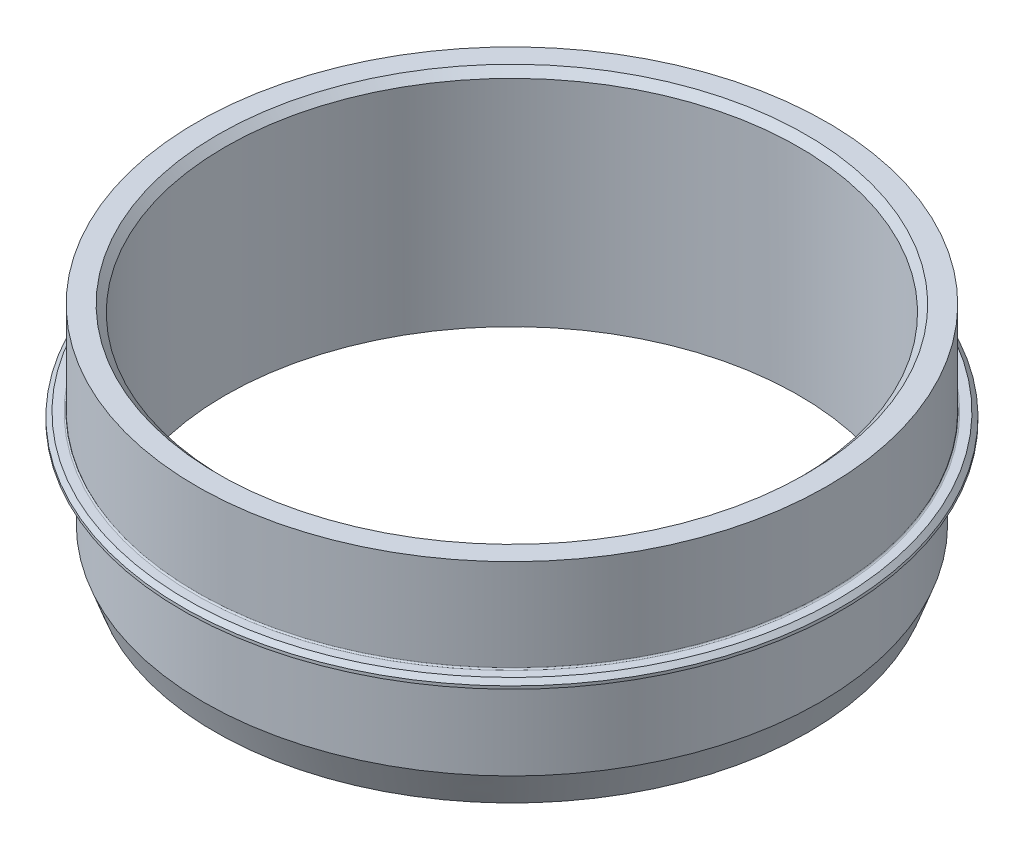
ISO-10303-21;
HEADER;
FILE_DESCRIPTION(('STEP AP214'),'2;1');
FILE_NAME('part.step','',(''),(''),'','','');
FILE_SCHEMA(('AUTOMOTIVE_DESIGN { 1 0 10303 214 1 1 1 1 }'));
ENDSEC;
DATA;
#1=APPLICATION_CONTEXT('core data for automotive mechanical design processes');
#2=APPLICATION_PROTOCOL_DEFINITION('international standard','automotive_design',2000,#1);
#3=PRODUCT_CONTEXT('',#1,'mechanical');
#4=PRODUCT('Part','Part','',(#3));
#5=PRODUCT_RELATED_PRODUCT_CATEGORY('part','',(#4));
#6=PRODUCT_DEFINITION_FORMATION('','',#4);
#7=PRODUCT_DEFINITION_CONTEXT('part definition',#1,'design');
#8=PRODUCT_DEFINITION('design','',#6,#7);
#9=PRODUCT_DEFINITION_SHAPE('','',#8);
#10=(LENGTH_UNIT() NAMED_UNIT(*) SI_UNIT(.MILLI.,.METRE.));
#11=(NAMED_UNIT(*) PLANE_ANGLE_UNIT() SI_UNIT($,.RADIAN.));
#12=(NAMED_UNIT(*) SI_UNIT($,.STERADIAN.) SOLID_ANGLE_UNIT());
#13=UNCERTAINTY_MEASURE_WITH_UNIT(LENGTH_MEASURE(1.E-05),#10,'distance_accuracy_value','');
#14=(GEOMETRIC_REPRESENTATION_CONTEXT(3) GLOBAL_UNCERTAINTY_ASSIGNED_CONTEXT((#13)) GLOBAL_UNIT_ASSIGNED_CONTEXT((#10,
#11,#12)) REPRESENTATION_CONTEXT('',''));
#15=CARTESIAN_POINT('',(0.,0.,0.));
#16=DIRECTION('',(0.,0.,1.));
#17=DIRECTION('',(1.,0.,0.));
#18=AXIS2_PLACEMENT_3D('',#15,#16,#17);
#19=CARTESIAN_POINT('',(0.,-33.5,659.57));
#20=DIRECTION('',(0.,1.,0.));
#21=DIRECTION('',(-1.,0.,0.));
#22=AXIS2_PLACEMENT_3D('',#19,#20,#21);
#23=PLANE('',#22);
#24=CARTESIAN_POINT('',(0.,-33.5,705.55));
#25=DIRECTION('',(0.,-1.,0.));
#26=DIRECTION('',(1.,0.,0.));
#27=AXIS2_PLACEMENT_3D('',#24,#25,#26);
#28=CIRCLE('',#27,44.18);
#29=CARTESIAN_POINT('',(44.18,-33.5,705.55));
#30=VERTEX_POINT('',#29);
#31=EDGE_CURVE('E105',#30,#30,#28,.T.);
#32=ORIENTED_EDGE('',*,*,#31,.T.);
#33=EDGE_LOOP('',(#32));
#34=FACE_BOUND('',#33,.T.);
#35=CARTESIAN_POINT('',(0.,-33.5,705.55));
#36=DIRECTION('',(0.,1.,0.));
#37=DIRECTION('',(1.,0.,0.));
#38=AXIS2_PLACEMENT_3D('',#35,#36,#37);
#39=CIRCLE('',#38,45.38);
#40=CARTESIAN_POINT('',(-45.38,-33.5,705.55));
#41=VERTEX_POINT('',#40);
#42=EDGE_CURVE('E108',#41,#41,#39,.T.);
#43=ORIENTED_EDGE('',*,*,#42,.T.);
#44=EDGE_LOOP('',(#43));
#45=FACE_BOUND('',#44,.T.);
#46=ADVANCED_FACE('F17',(#34,#45),#23,.T.);
#47=CARTESIAN_POINT('',(0.,-34.5,662.57));
#48=DIRECTION('',(0.,-1.,0.));
#49=DIRECTION('',(0.,0.,1.));
#50=AXIS2_PLACEMENT_3D('',#47,#48,#49);
#51=PLANE('',#50);
#52=CARTESIAN_POINT('',(0.,-34.5,705.55));
#53=DIRECTION('',(0.,-1.,0.));
#54=DIRECTION('',(-1.,0.,0.));
#55=AXIS2_PLACEMENT_3D('',#52,#53,#54);
#56=CIRCLE('',#55,42.98);
#57=CARTESIAN_POINT('',(42.98,-34.5,705.55));
#58=VERTEX_POINT('',#57);
#59=EDGE_CURVE('E28',#58,#58,#56,.T.);
#60=ORIENTED_EDGE('',*,*,#59,.F.);
#61=EDGE_LOOP('',(#60));
#62=FACE_BOUND('',#61,.T.);
#63=CARTESIAN_POINT('',(0.,-34.5,705.55));
#64=DIRECTION('',(0.,-1.,0.));
#65=DIRECTION('',(-1.,0.,0.));
#66=AXIS2_PLACEMENT_3D('',#63,#64,#65);
#67=CIRCLE('',#66,45.98);
#68=CARTESIAN_POINT('',(-45.98,-34.5,705.55));
#69=VERTEX_POINT('',#68);
#70=EDGE_CURVE('E126',#69,#69,#67,.T.);
#71=ORIENTED_EDGE('',*,*,#70,.T.);
#72=EDGE_LOOP('',(#71));
#73=FACE_BOUND('',#72,.T.);
#74=ADVANCED_FACE('F19',(#62,#73),#51,.T.);
#75=CARTESIAN_POINT('',(0.,-51.5,665.53));
#76=DIRECTION('',(0.,-1.,0.));
#77=DIRECTION('',(0.,0.,1.));
#78=AXIS2_PLACEMENT_3D('',#75,#76,#77);
#79=PLANE('',#78);
#80=CARTESIAN_POINT('',(0.,-51.5,705.55));
#81=DIRECTION('',(0.,-1.,0.));
#82=DIRECTION('',(-1.,0.,0.));
#83=AXIS2_PLACEMENT_3D('',#80,#81,#82);
#84=CIRCLE('',#83,40.02);
#85=CARTESIAN_POINT('',(-40.02,-51.5,705.55));
#86=VERTEX_POINT('',#85);
#87=EDGE_CURVE('E11',#86,#86,#84,.T.);
#88=ORIENTED_EDGE('',*,*,#87,.F.);
#89=EDGE_LOOP('',(#88));
#90=FACE_BOUND('',#89,.T.);
#91=CARTESIAN_POINT('',(0.,-51.5,705.55));
#92=DIRECTION('',(0.,-1.,0.));
#93=DIRECTION('',(-1.,0.,0.));
#94=AXIS2_PLACEMENT_3D('',#91,#92,#93);
#95=CIRCLE('',#94,41.38);
#96=CARTESIAN_POINT('',(41.38,-51.5,705.55));
#97=VERTEX_POINT('',#96);
#98=EDGE_CURVE('E77',#97,#97,#95,.T.);
#99=ORIENTED_EDGE('',*,*,#98,.T.);
#100=EDGE_LOOP('',(#99));
#101=FACE_BOUND('',#100,.T.);
#102=ADVANCED_FACE('F166',(#90,#101),#79,.T.);
#103=CARTESIAN_POINT('',(0.,-20.5,661.57));
#104=DIRECTION('',(0.,1.,0.));
#105=DIRECTION('',(-1.,0.,0.));
#106=AXIS2_PLACEMENT_3D('',#103,#104,#105);
#107=PLANE('',#106);
#108=CARTESIAN_POINT('',(0.,-20.5,705.55));
#109=DIRECTION('',(0.,-1.,0.));
#110=DIRECTION('',(1.,0.,0.));
#111=AXIS2_PLACEMENT_3D('',#108,#109,#110);
#112=CIRCLE('',#111,41.02);
#113=CARTESIAN_POINT('',(41.02,-20.5,705.55));
#114=VERTEX_POINT('',#113);
#115=EDGE_CURVE('E21',#114,#114,#112,.T.);
#116=ORIENTED_EDGE('',*,*,#115,.T.);
#117=EDGE_LOOP('',(#116));
#118=FACE_BOUND('',#117,.T.);
#119=CARTESIAN_POINT('',(0.,-20.5,705.55));
#120=DIRECTION('',(0.,-1.,0.));
#121=DIRECTION('',(-1.,0.,0.));
#122=AXIS2_PLACEMENT_3D('',#119,#120,#121);
#123=CIRCLE('',#122,43.98);
#124=CARTESIAN_POINT('',(43.98,-20.5,705.55));
#125=VERTEX_POINT('',#124);
#126=EDGE_CURVE('E116',#125,#125,#123,.T.);
#127=ORIENTED_EDGE('',*,*,#126,.F.);
#128=EDGE_LOOP('',(#127));
#129=FACE_BOUND('',#128,.T.);
#130=ADVANCED_FACE('F84',(#118,#129),#107,.T.);
#131=CARTESIAN_POINT('',(0.,-20.5,705.55));
#132=DIRECTION('',(0.,-1.,0.));
#133=DIRECTION('',(-1.,0.,0.));
#134=AXIS2_PLACEMENT_3D('',#131,#132,#133);
#135=CYLINDRICAL_SURFACE('',#134,40.02);
#136=ORIENTED_EDGE('',*,*,#87,.T.);
#137=EDGE_LOOP('',(#136));
#138=FACE_BOUND('',#137,.T.);
#139=CARTESIAN_POINT('',(0.,-21.5,705.55));
#140=DIRECTION('',(0.,1.,0.));
#141=DIRECTION('',(1.,0.,0.));
#142=AXIS2_PLACEMENT_3D('',#139,#140,#141);
#143=CIRCLE('',#142,40.02);
#144=CARTESIAN_POINT('',(40.02,-21.5,705.55));
#145=VERTEX_POINT('',#144);
#146=EDGE_CURVE('E88',#145,#145,#143,.T.);
#147=ORIENTED_EDGE('',*,*,#146,.T.);
#148=EDGE_LOOP('',(#147));
#149=FACE_BOUND('',#148,.T.);
#150=ADVANCED_FACE('F182',(#138,#149),#135,.F.);
#151=CARTESIAN_POINT('',(0.,-20.5,705.55));
#152=DIRECTION('',(0.,-1.,0.));
#153=DIRECTION('',(-1.,0.,0.));
#154=AXIS2_PLACEMENT_3D('',#151,#152,#153);
#155=CYLINDRICAL_SURFACE('',#154,42.98);
#156=CARTESIAN_POINT('',(0.,-47.1040361288726,705.55));
#157=DIRECTION('',(0.,1.,0.));
#158=DIRECTION('',(-1.,0.,0.));
#159=AXIS2_PLACEMENT_3D('',#156,#157,#158);
#160=CIRCLE('',#159,42.98);
#161=CARTESIAN_POINT('',(42.98,-47.1040361288726,705.55));
#162=VERTEX_POINT('',#161);
#163=EDGE_CURVE('E71',#162,#162,#160,.T.);
#164=ORIENTED_EDGE('',*,*,#163,.T.);
#165=EDGE_LOOP('',(#164));
#166=FACE_BOUND('',#165,.T.);
#167=ORIENTED_EDGE('',*,*,#59,.T.);
#168=EDGE_LOOP('',(#167));
#169=FACE_BOUND('',#168,.T.);
#170=ADVANCED_FACE('F175',(#166,#169),#155,.T.);
#171=CARTESIAN_POINT('',(0.,-20.5,705.55));
#172=DIRECTION('',(0.,-1.,0.));
#173=DIRECTION('',(-1.,0.,0.));
#174=AXIS2_PLACEMENT_3D('',#171,#172,#173);
#175=CYLINDRICAL_SURFACE('',#174,45.98);
#176=ORIENTED_EDGE('',*,*,#70,.F.);
#177=EDGE_LOOP('',(#176));
#178=FACE_BOUND('',#177,.T.);
#179=CARTESIAN_POINT('',(0.,-34.1,705.55));
#180=DIRECTION('',(0.,-1.,0.));
#181=DIRECTION('',(1.,0.,0.));
#182=AXIS2_PLACEMENT_3D('',#179,#180,#181);
#183=CIRCLE('',#182,45.98);
#184=CARTESIAN_POINT('',(-45.98,-34.1,705.55));
#185=VERTEX_POINT('',#184);
#186=EDGE_CURVE('E110',#185,#185,#183,.T.);
#187=ORIENTED_EDGE('',*,*,#186,.T.);
#188=EDGE_LOOP('',(#187));
#189=FACE_BOUND('',#188,.T.);
#190=ADVANCED_FACE('F173',(#178,#189),#175,.T.);
#191=CARTESIAN_POINT('',(0.,-20.5,705.55));
#192=DIRECTION('',(0.,-1.,0.));
#193=DIRECTION('',(-1.,0.,0.));
#194=AXIS2_PLACEMENT_3D('',#191,#192,#193);
#195=CYLINDRICAL_SURFACE('',#194,43.98);
#196=CARTESIAN_POINT('',(0.,-33.3,705.55));
#197=DIRECTION('',(0.,1.,0.));
#198=DIRECTION('',(1.,0.,0.));
#199=AXIS2_PLACEMENT_3D('',#196,#197,#198);
#200=CIRCLE('',#199,43.98);
#201=CARTESIAN_POINT('',(43.98,-33.3,705.55));
#202=VERTEX_POINT('',#201);
#203=EDGE_CURVE('E103',#202,#202,#200,.T.);
#204=ORIENTED_EDGE('',*,*,#203,.T.);
#205=EDGE_LOOP('',(#204));
#206=FACE_BOUND('',#205,.T.);
#207=ORIENTED_EDGE('',*,*,#126,.T.);
#208=EDGE_LOOP('',(#207));
#209=FACE_BOUND('',#208,.T.);
#210=ADVANCED_FACE('F138',(#206,#209),#195,.T.);
#211=CARTESIAN_POINT('',(0.,-34.1,705.55));
#212=DIRECTION('',(0.,-1.,0.));
#213=DIRECTION('',(-1.,0.,0.));
#214=AXIS2_PLACEMENT_3D('',#211,#212,#213);
#215=CONICAL_SURFACE('',#214,45.98,0.785398163397448);
#216=ORIENTED_EDGE('',*,*,#186,.F.);
#217=EDGE_LOOP('',(#216));
#218=FACE_BOUND('',#217,.T.);
#219=ORIENTED_EDGE('',*,*,#42,.F.);
#220=EDGE_LOOP('',(#219));
#221=FACE_BOUND('',#220,.T.);
#222=ADVANCED_FACE('F144',(#218,#221),#215,.T.);
#223=CARTESIAN_POINT('',(0.,-33.3,705.55));
#224=DIRECTION('',(0.,1.,0.));
#225=DIRECTION('',(1.,0.,0.));
#226=AXIS2_PLACEMENT_3D('',#223,#224,#225);
#227=TOROIDAL_SURFACE('',#226,44.18,0.2);
#228=ORIENTED_EDGE('',*,*,#31,.F.);
#229=EDGE_LOOP('',(#228));
#230=FACE_BOUND('',#229,.T.);
#231=ORIENTED_EDGE('',*,*,#203,.F.);
#232=EDGE_LOOP('',(#231));
#233=FACE_BOUND('',#232,.T.);
#234=ADVANCED_FACE('F141',(#230,#233),#227,.F.);
#235=CARTESIAN_POINT('',(0.,-51.5,705.55));
#236=DIRECTION('',(0.,1.,0.));
#237=DIRECTION('',(1.,0.,0.));
#238=AXIS2_PLACEMENT_3D('',#235,#236,#237);
#239=CONICAL_SURFACE('',#238,41.38,0.349065850398867);
#240=ORIENTED_EDGE('',*,*,#163,.F.);
#241=EDGE_LOOP('',(#240));
#242=FACE_BOUND('',#241,.T.);
#243=ORIENTED_EDGE('',*,*,#98,.F.);
#244=EDGE_LOOP('',(#243));
#245=FACE_BOUND('',#244,.T.);
#246=ADVANCED_FACE('F143',(#242,#245),#239,.T.);
#247=CARTESIAN_POINT('',(0.,-20.5,705.55));
#248=DIRECTION('',(0.,1.,0.));
#249=DIRECTION('',(1.,0.,0.));
#250=AXIS2_PLACEMENT_3D('',#247,#248,#249);
#251=CONICAL_SURFACE('',#250,41.02,0.785398163397438);
#252=ORIENTED_EDGE('',*,*,#115,.F.);
#253=EDGE_LOOP('',(#252));
#254=FACE_BOUND('',#253,.T.);
#255=ORIENTED_EDGE('',*,*,#146,.F.);
#256=EDGE_LOOP('',(#255));
#257=FACE_BOUND('',#256,.T.);
#258=ADVANCED_FACE('F152',(#254,#257),#251,.F.);
#259=CLOSED_SHELL('',(#46,#74,#102,#130,#150,#170,#190,#210,#222,#234,#246,#258));
#260=MANIFOLD_SOLID_BREP('B1',#259);
#261=ADVANCED_BREP_SHAPE_REPRESENTATION('',(#18,#260),#14);
#262=SHAPE_DEFINITION_REPRESENTATION(#9,#261);
ENDSEC;
END-ISO-10303-21;
